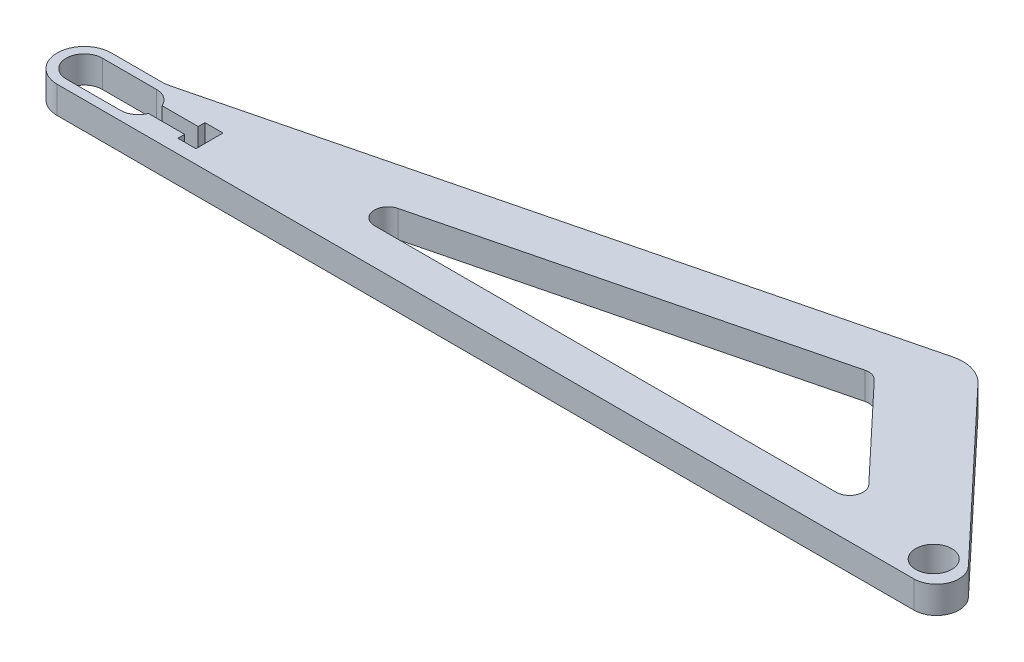
ISO-10303-21;
HEADER;
FILE_DESCRIPTION(('STEP AP214'),'2;1');
FILE_NAME('part.step','',(''),(''),'','','');
FILE_SCHEMA(('AUTOMOTIVE_DESIGN { 1 0 10303 214 1 1 1 1 }'));
ENDSEC;
DATA;
#1=APPLICATION_CONTEXT('core data for automotive mechanical design processes');
#2=APPLICATION_PROTOCOL_DEFINITION('international standard','automotive_design',2000,#1);
#3=PRODUCT_CONTEXT('',#1,'mechanical');
#4=PRODUCT('Part','Part','',(#3));
#5=PRODUCT_RELATED_PRODUCT_CATEGORY('part','',(#4));
#6=PRODUCT_DEFINITION_FORMATION('','',#4);
#7=PRODUCT_DEFINITION_CONTEXT('part definition',#1,'design');
#8=PRODUCT_DEFINITION('design','',#6,#7);
#9=PRODUCT_DEFINITION_SHAPE('','',#8);
#10=(LENGTH_UNIT() NAMED_UNIT(*) SI_UNIT(.MILLI.,.METRE.));
#11=(NAMED_UNIT(*) PLANE_ANGLE_UNIT() SI_UNIT($,.RADIAN.));
#12=(NAMED_UNIT(*) SI_UNIT($,.STERADIAN.) SOLID_ANGLE_UNIT());
#13=UNCERTAINTY_MEASURE_WITH_UNIT(LENGTH_MEASURE(1.E-05),#10,'distance_accuracy_value','');
#14=(GEOMETRIC_REPRESENTATION_CONTEXT(3) GLOBAL_UNCERTAINTY_ASSIGNED_CONTEXT((#13)) GLOBAL_UNIT_ASSIGNED_CONTEXT((#10,
#11,#12)) REPRESENTATION_CONTEXT('',''));
#15=CARTESIAN_POINT('',(0.,0.,0.));
#16=DIRECTION('',(0.,0.,1.));
#17=DIRECTION('',(1.,0.,0.));
#18=AXIS2_PLACEMENT_3D('',#15,#16,#17);
#19=CARTESIAN_POINT('',(5.09378784851541,19.05,3.175));
#20=DIRECTION('',(0.,-1.,0.));
#21=DIRECTION('',(0.,0.,-1.));
#22=AXIS2_PLACEMENT_3D('',#19,#20,#21);
#23=PLANE('',#22);
#24=CARTESIAN_POINT('',(-596.9,19.05,0.));
#25=DIRECTION('',(0.,1.,0.));
#26=DIRECTION('',(0.,0.,1.));
#27=AXIS2_PLACEMENT_3D('',#24,#25,#26);
#28=CIRCLE('',#27,12.7);
#29=CARTESIAN_POINT('',(-596.9,19.05,-12.6999999999999));
#30=VERTEX_POINT('',#29);
#31=CARTESIAN_POINT('',(-596.9,19.05,12.7000000000001));
#32=VERTEX_POINT('',#31);
#33=EDGE_CURVE('E260',#30,#32,#28,.T.);
#34=ORIENTED_EDGE('',*,*,#33,.F.);
#35=DIRECTION('',(-1.,0.,0.));
#36=VECTOR('',#35,1.);
#37=CARTESIAN_POINT('',(-596.9,19.05,-12.6999999999999));
#38=LINE('',#37,#36);
#39=CARTESIAN_POINT('',(-558.8,19.05,-12.6999999999999));
#40=VERTEX_POINT('',#39);
#41=EDGE_CURVE('E284',#40,#30,#38,.T.);
#42=ORIENTED_EDGE('',*,*,#41,.F.);
#43=CARTESIAN_POINT('',(-558.8,19.05,0.));
#44=DIRECTION('',(0.,1.,0.));
#45=DIRECTION('',(0.,0.,1.));
#46=AXIS2_PLACEMENT_3D('',#43,#44,#45);
#47=CIRCLE('',#46,12.7);
#48=CARTESIAN_POINT('',(-547.026784901736,19.05,-4.76249999999993));
#49=VERTEX_POINT('',#48);
#50=EDGE_CURVE('E281',#49,#40,#47,.T.);
#51=ORIENTED_EDGE('',*,*,#50,.F.);
#52=DIRECTION('',(-1.,0.,0.));
#53=VECTOR('',#52,1.);
#54=CARTESIAN_POINT('',(-547.026784901736,19.05,-4.76249999999993));
#55=LINE('',#54,#53);
#56=CARTESIAN_POINT('',(-521.626784901736,19.05,-4.76249999999993));
#57=VERTEX_POINT('',#56);
#58=EDGE_CURVE('E279',#57,#49,#55,.T.);
#59=ORIENTED_EDGE('',*,*,#58,.F.);
#60=DIRECTION('',(0.,0.,1.));
#61=VECTOR('',#60,1.);
#62=CARTESIAN_POINT('',(-521.626784901736,19.05,-4.76249999999993));
#63=LINE('',#62,#61);
#64=CARTESIAN_POINT('',(-521.626784901736,19.05,-9.52499999999993));
#65=VERTEX_POINT('',#64);
#66=EDGE_CURVE('E277',#65,#57,#63,.T.);
#67=ORIENTED_EDGE('',*,*,#66,.F.);
#68=DIRECTION('',(-1.,0.,0.));
#69=VECTOR('',#68,1.);
#70=CARTESIAN_POINT('',(-521.626784901736,19.05,-9.52499999999993));
#71=LINE('',#70,#69);
#72=CARTESIAN_POINT('',(-508.926784901736,19.05,-9.52499999999993));
#73=VERTEX_POINT('',#72);
#74=EDGE_CURVE('E275',#73,#65,#71,.T.);
#75=ORIENTED_EDGE('',*,*,#74,.F.);
#76=DIRECTION('',(0.,0.,-1.));
#77=VECTOR('',#76,1.);
#78=CARTESIAN_POINT('',(-508.926784901736,19.05,9.52500000000006));
#79=LINE('',#78,#77);
#80=CARTESIAN_POINT('',(-508.926784901736,19.05,9.52500000000006));
#81=VERTEX_POINT('',#80);
#82=EDGE_CURVE('E273',#81,#73,#79,.T.);
#83=ORIENTED_EDGE('',*,*,#82,.F.);
#84=DIRECTION('',(1.,0.,0.));
#85=VECTOR('',#84,1.);
#86=CARTESIAN_POINT('',(-521.626784901736,19.05,9.52500000000006));
#87=LINE('',#86,#85);
#88=CARTESIAN_POINT('',(-521.626784901736,19.05,9.52500000000006));
#89=VERTEX_POINT('',#88);
#90=EDGE_CURVE('E271',#89,#81,#87,.T.);
#91=ORIENTED_EDGE('',*,*,#90,.F.);
#92=DIRECTION('',(0.,0.,1.));
#93=VECTOR('',#92,1.);
#94=CARTESIAN_POINT('',(-521.626784901736,19.05,4.76250000000007));
#95=LINE('',#94,#93);
#96=CARTESIAN_POINT('',(-521.626784901736,19.05,4.76250000000007));
#97=VERTEX_POINT('',#96);
#98=EDGE_CURVE('E269',#97,#89,#95,.T.);
#99=ORIENTED_EDGE('',*,*,#98,.F.);
#100=DIRECTION('',(1.,0.,0.));
#101=VECTOR('',#100,1.);
#102=CARTESIAN_POINT('',(-547.026784901736,19.05,4.76250000000007));
#103=LINE('',#102,#101);
#104=CARTESIAN_POINT('',(-547.026784901736,19.05,4.76250000000007));
#105=VERTEX_POINT('',#104);
#106=EDGE_CURVE('E267',#105,#97,#103,.T.);
#107=ORIENTED_EDGE('',*,*,#106,.F.);
#108=CARTESIAN_POINT('',(-558.8,19.05,0.));
#109=DIRECTION('',(0.,1.,0.));
#110=DIRECTION('',(0.,0.,1.));
#111=AXIS2_PLACEMENT_3D('',#108,#109,#110);
#112=CIRCLE('',#111,12.7);
#113=CARTESIAN_POINT('',(-558.8,19.05,12.7000000000001));
#114=VERTEX_POINT('',#113);
#115=EDGE_CURVE('E265',#114,#105,#112,.T.);
#116=ORIENTED_EDGE('',*,*,#115,.F.);
#117=DIRECTION('',(1.,0.,0.));
#118=VECTOR('',#117,1.);
#119=CARTESIAN_POINT('',(-596.9,19.05,12.7000000000001));
#120=LINE('',#119,#118);
#121=EDGE_CURVE('E262',#32,#114,#120,.T.);
#122=ORIENTED_EDGE('',*,*,#121,.F.);
#123=EDGE_LOOP('',(#34,#42,#51,#59,#67,#75,#83,#91,#99,#107,#116,#122));
#124=FACE_BOUND('',#123,.T.);
#125=DIRECTION('',(1.,0.,0.));
#126=VECTOR('',#125,1.);
#127=CARTESIAN_POINT('',(0.,19.05,19.05));
#128=LINE('',#127,#126);
#129=CARTESIAN_POINT('',(-596.9,19.05,19.0500000000001));
#130=VERTEX_POINT('',#129);
#131=CARTESIAN_POINT('',(5.09378784851506,19.05,19.05));
#132=VERTEX_POINT('',#131);
#133=EDGE_CURVE('E353',#130,#132,#128,.T.);
#134=ORIENTED_EDGE('',*,*,#133,.T.);
#135=CARTESIAN_POINT('',(5.09378784851541,19.05,3.175));
#136=DIRECTION('',(0.,1.,0.));
#137=DIRECTION('',(0.,0.,-1.));
#138=AXIS2_PLACEMENT_3D('',#135,#136,#137);
#139=CIRCLE('',#138,15.875);
#140=CARTESIAN_POINT('',(16.6539627325134,19.05,-7.70516459670449));
#141=VERTEX_POINT('',#140);
#142=EDGE_CURVE('E356',#132,#141,#139,.T.);
#143=ORIENTED_EDGE('',*,*,#142,.T.);
#144=DIRECTION('',(-0.685364699004991,0.,-0.728199992692803));
#145=VECTOR('',#144,1.);
#146=CARTESIAN_POINT('',(0.,19.05,-25.4));
#147=LINE('',#146,#145);
#148=CARTESIAN_POINT('',(-91.392360135966,19.05,-122.504382644464));
#149=VERTEX_POINT('',#148);
#150=EDGE_CURVE('E359',#141,#149,#147,.T.);
#151=ORIENTED_EDGE('',*,*,#150,.T.);
#152=CARTESIAN_POINT('',(-109.888639950363,19.05,-105.096119289737));
#153=DIRECTION('',(0.,1.,0.));
#154=DIRECTION('',(0.,0.,-1.));
#155=AXIS2_PLACEMENT_3D('',#152,#153,#154);
#156=CIRCLE('',#155,25.4);
#157=CARTESIAN_POINT('',(-116.049044826286,19.05,-129.737738793428));
#158=VERTEX_POINT('',#157);
#159=EDGE_CURVE('E361',#149,#158,#156,.T.);
#160=ORIENTED_EDGE('',*,*,#159,.T.);
#161=DIRECTION('',(-0.970142500145332,0.,0.242535625036333));
#162=VECTOR('',#161,1.);
#163=CARTESIAN_POINT('',(-555.766478014766,19.05,-19.8083804963085));
#164=LINE('',#163,#162);
#165=CARTESIAN_POINT('',(-555.766478014766,19.05,-19.8083804963085));
#166=VERTEX_POINT('',#165);
#167=EDGE_CURVE('E363',#158,#166,#164,.T.);
#168=ORIENTED_EDGE('',*,*,#167,.T.);
#169=CARTESIAN_POINT('',(-561.926882890689,19.05,-44.4499999999999));
#170=DIRECTION('',(0.,-1.,0.));
#171=DIRECTION('',(0.,0.,-1.));
#172=AXIS2_PLACEMENT_3D('',#169,#170,#171);
#173=CIRCLE('',#172,25.4);
#174=CARTESIAN_POINT('',(-561.926882890689,19.05,-19.0499999999999));
#175=VERTEX_POINT('',#174);
#176=EDGE_CURVE('E365',#166,#175,#173,.T.);
#177=ORIENTED_EDGE('',*,*,#176,.T.);
#178=DIRECTION('',(-1.,0.,0.));
#179=VECTOR('',#178,1.);
#180=CARTESIAN_POINT('',(-561.926882890689,19.05,-19.0499999999999));
#181=LINE('',#180,#179);
#182=CARTESIAN_POINT('',(-596.9,19.05,-19.0499999999999));
#183=VERTEX_POINT('',#182);
#184=EDGE_CURVE('E367',#175,#183,#181,.T.);
#185=ORIENTED_EDGE('',*,*,#184,.T.);
#186=CARTESIAN_POINT('',(-596.9,19.05,0.));
#187=DIRECTION('',(0.,1.,0.));
#188=DIRECTION('',(0.,0.,1.));
#189=AXIS2_PLACEMENT_3D('',#186,#187,#188);
#190=CIRCLE('',#189,19.05);
#191=EDGE_CURVE('E369',#183,#130,#190,.T.);
#192=ORIENTED_EDGE('',*,*,#191,.T.);
#193=EDGE_LOOP('',(#134,#143,#151,#160,#168,#177,#185,#192));
#194=FACE_BOUND('',#193,.T.);
#195=CARTESIAN_POINT('',(0.,19.05,0.));
#196=DIRECTION('',(0.,1.,0.));
#197=DIRECTION('',(0.,0.,1.));
#198=AXIS2_PLACEMENT_3D('',#195,#196,#197);
#199=CIRCLE('',#198,12.7);
#200=CARTESIAN_POINT('',(0.,19.05,12.7));
#201=VERTEX_POINT('',#200);
#202=EDGE_CURVE('E347',#201,#201,#199,.T.);
#203=ORIENTED_EDGE('',*,*,#202,.F.);
#204=EDGE_LOOP('',(#203));
#205=FACE_BOUND('',#204,.T.);
#206=CARTESIAN_POINT('',(-399.35637252841,19.05,-15.8749999999999));
#207=DIRECTION('',(0.,1.,0.));
#208=DIRECTION('',(0.,0.,1.));
#209=AXIS2_PLACEMENT_3D('',#206,#207,#208);
#210=CIRCLE('',#209,9.52499999999999);
#211=CARTESIAN_POINT('',(-401.666524356881,19.05,-25.1156073138842));
#212=VERTEX_POINT('',#211);
#213=CARTESIAN_POINT('',(-399.35637252841,19.05,-6.34999999999995));
#214=VERTEX_POINT('',#213);
#215=EDGE_CURVE('E209',#212,#214,#210,.T.);
#216=ORIENTED_EDGE('',*,*,#215,.F.);
#217=DIRECTION('',(-0.970142500145332,0.,0.242535625036333));
#218=VECTOR('',#217,1.);
#219=CARTESIAN_POINT('',(-401.666524356881,19.05,-25.1156073138842));
#220=LINE('',#219,#218);
#221=CARTESIAN_POINT('',(-139.081054890051,19.05,-90.7619746805916));
#222=VERTEX_POINT('',#221);
#223=EDGE_CURVE('E238',#222,#212,#220,.T.);
#224=ORIENTED_EDGE('',*,*,#223,.F.);
#225=CARTESIAN_POINT('',(-136.77090306158,19.05,-81.5213673667074));
#226=DIRECTION('',(0.,1.,0.));
#227=DIRECTION('',(0.,0.,-1.));
#228=AXIS2_PLACEMENT_3D('',#225,#226,#227);
#229=CIRCLE('',#228,9.52499999999998);
#230=CARTESIAN_POINT('',(-129.834798131181,19.05,-88.0494661247299));
#231=VERTEX_POINT('',#230);
#232=EDGE_CURVE('E236',#231,#222,#229,.T.);
#233=ORIENTED_EDGE('',*,*,#232,.F.);
#234=DIRECTION('',(-0.685364699004991,0.,-0.728199992692803));
#235=VECTOR('',#234,1.);
#236=CARTESIAN_POINT('',(-129.834798131181,19.05,-88.0494661247299));
#237=LINE('',#236,#235);
#238=CARTESIAN_POINT('',(-68.0499817860451,19.05,-22.4030987580225));
#239=VERTEX_POINT('',#238);
#240=EDGE_CURVE('E232',#239,#231,#237,.T.);
#241=ORIENTED_EDGE('',*,*,#240,.F.);
#242=CARTESIAN_POINT('',(-74.9860867164441,19.05,-15.875));
#243=DIRECTION('',(0.,1.,0.));
#244=DIRECTION('',(0.,0.,-1.));
#245=AXIS2_PLACEMENT_3D('',#242,#243,#244);
#246=CIRCLE('',#245,9.525);
#247=CARTESIAN_POINT('',(-74.9860867164441,19.05,-6.34999999999999));
#248=VERTEX_POINT('',#247);
#249=EDGE_CURVE('E230',#248,#239,#246,.T.);
#250=ORIENTED_EDGE('',*,*,#249,.F.);
#251=DIRECTION('',(1.,0.,0.));
#252=VECTOR('',#251,1.);
#253=CARTESIAN_POINT('',(-74.9860867164441,19.05,-6.34999999999998));
#254=LINE('',#253,#252);
#255=EDGE_CURVE('E217',#214,#248,#254,.T.);
#256=ORIENTED_EDGE('',*,*,#255,.F.);
#257=EDGE_LOOP('',(#216,#224,#233,#241,#250,#256));
#258=FACE_BOUND('',#257,.T.);
#259=ADVANCED_FACE('F36',(#124,#194,#205,#258),#23,.F.);
#260=CARTESIAN_POINT('',(5.09378784851541,0.,3.175));
#261=DIRECTION('',(0.,-1.,0.));
#262=DIRECTION('',(0.,0.,-1.));
#263=AXIS2_PLACEMENT_3D('',#260,#261,#262);
#264=PLANE('',#263);
#265=DIRECTION('',(-1.,0.,0.));
#266=VECTOR('',#265,1.);
#267=CARTESIAN_POINT('',(-596.9,0.,-12.6999999999999));
#268=LINE('',#267,#266);
#269=CARTESIAN_POINT('',(-558.8,0.,-12.6999999999999));
#270=VERTEX_POINT('',#269);
#271=CARTESIAN_POINT('',(-596.9,0.,-12.6999999999999));
#272=VERTEX_POINT('',#271);
#273=EDGE_CURVE('E263',#270,#272,#268,.T.);
#274=ORIENTED_EDGE('',*,*,#273,.T.);
#275=CARTESIAN_POINT('',(-596.9,0.,0.));
#276=DIRECTION('',(0.,1.,0.));
#277=DIRECTION('',(0.,0.,1.));
#278=AXIS2_PLACEMENT_3D('',#275,#276,#277);
#279=CIRCLE('',#278,12.7);
#280=CARTESIAN_POINT('',(-596.9,0.,12.7000000000001));
#281=VERTEX_POINT('',#280);
#282=EDGE_CURVE('E225',#272,#281,#279,.T.);
#283=ORIENTED_EDGE('',*,*,#282,.T.);
#284=DIRECTION('',(1.,0.,0.));
#285=VECTOR('',#284,1.);
#286=CARTESIAN_POINT('',(-596.9,0.,12.7000000000001));
#287=LINE('',#286,#285);
#288=CARTESIAN_POINT('',(-558.8,0.,12.7000000000001));
#289=VERTEX_POINT('',#288);
#290=EDGE_CURVE('E289',#281,#289,#287,.T.);
#291=ORIENTED_EDGE('',*,*,#290,.T.);
#292=CARTESIAN_POINT('',(-558.8,0.,0.));
#293=DIRECTION('',(0.,1.,0.));
#294=DIRECTION('',(0.,0.,1.));
#295=AXIS2_PLACEMENT_3D('',#292,#293,#294);
#296=CIRCLE('',#295,12.7);
#297=CARTESIAN_POINT('',(-547.026784901736,0.,4.76250000000007));
#298=VERTEX_POINT('',#297);
#299=EDGE_CURVE('E292',#289,#298,#296,.T.);
#300=ORIENTED_EDGE('',*,*,#299,.T.);
#301=DIRECTION('',(1.,0.,0.));
#302=VECTOR('',#301,1.);
#303=CARTESIAN_POINT('',(-547.026784901736,0.,4.76250000000007));
#304=LINE('',#303,#302);
#305=CARTESIAN_POINT('',(-521.626784901736,0.,4.76250000000007));
#306=VERTEX_POINT('',#305);
#307=EDGE_CURVE('E295',#298,#306,#304,.T.);
#308=ORIENTED_EDGE('',*,*,#307,.T.);
#309=DIRECTION('',(0.,0.,1.));
#310=VECTOR('',#309,1.);
#311=CARTESIAN_POINT('',(-521.626784901736,0.,4.76250000000007));
#312=LINE('',#311,#310);
#313=CARTESIAN_POINT('',(-521.626784901736,0.,9.52500000000006));
#314=VERTEX_POINT('',#313);
#315=EDGE_CURVE('E298',#306,#314,#312,.T.);
#316=ORIENTED_EDGE('',*,*,#315,.T.);
#317=DIRECTION('',(1.,0.,0.));
#318=VECTOR('',#317,1.);
#319=CARTESIAN_POINT('',(-521.626784901736,0.,9.52500000000006));
#320=LINE('',#319,#318);
#321=CARTESIAN_POINT('',(-508.926784901736,0.,9.52500000000006));
#322=VERTEX_POINT('',#321);
#323=EDGE_CURVE('E301',#314,#322,#320,.T.);
#324=ORIENTED_EDGE('',*,*,#323,.T.);
#325=DIRECTION('',(0.,0.,-1.));
#326=VECTOR('',#325,1.);
#327=CARTESIAN_POINT('',(-508.926784901736,0.,9.52500000000006));
#328=LINE('',#327,#326);
#329=CARTESIAN_POINT('',(-508.926784901736,0.,-9.52499999999993));
#330=VERTEX_POINT('',#329);
#331=EDGE_CURVE('E304',#322,#330,#328,.T.);
#332=ORIENTED_EDGE('',*,*,#331,.T.);
#333=DIRECTION('',(-1.,0.,0.));
#334=VECTOR('',#333,1.);
#335=CARTESIAN_POINT('',(-521.626784901736,0.,-9.52499999999993));
#336=LINE('',#335,#334);
#337=CARTESIAN_POINT('',(-521.626784901736,0.,-9.52499999999993));
#338=VERTEX_POINT('',#337);
#339=EDGE_CURVE('E307',#330,#338,#336,.T.);
#340=ORIENTED_EDGE('',*,*,#339,.T.);
#341=DIRECTION('',(0.,0.,1.));
#342=VECTOR('',#341,1.);
#343=CARTESIAN_POINT('',(-521.626784901736,0.,-4.76249999999993));
#344=LINE('',#343,#342);
#345=CARTESIAN_POINT('',(-521.626784901736,0.,-4.76249999999993));
#346=VERTEX_POINT('',#345);
#347=EDGE_CURVE('E310',#338,#346,#344,.T.);
#348=ORIENTED_EDGE('',*,*,#347,.T.);
#349=DIRECTION('',(-1.,0.,0.));
#350=VECTOR('',#349,1.);
#351=CARTESIAN_POINT('',(-547.026784901736,0.,-4.76249999999993));
#352=LINE('',#351,#350);
#353=CARTESIAN_POINT('',(-547.026784901736,0.,-4.76249999999993));
#354=VERTEX_POINT('',#353);
#355=EDGE_CURVE('E313',#346,#354,#352,.T.);
#356=ORIENTED_EDGE('',*,*,#355,.T.);
#357=CARTESIAN_POINT('',(-558.8,0.,0.));
#358=DIRECTION('',(0.,1.,0.));
#359=DIRECTION('',(0.,0.,1.));
#360=AXIS2_PLACEMENT_3D('',#357,#358,#359);
#361=CIRCLE('',#360,12.7);
#362=EDGE_CURVE('E316',#354,#270,#361,.T.);
#363=ORIENTED_EDGE('',*,*,#362,.T.);
#364=EDGE_LOOP('',(#274,#283,#291,#300,#308,#316,#324,#332,#340,#348,#356,#363));
#365=FACE_BOUND('',#364,.T.);
#366=CARTESIAN_POINT('',(5.09378784851541,0.,3.175));
#367=DIRECTION('',(0.,1.,0.));
#368=DIRECTION('',(0.,0.,-1.));
#369=AXIS2_PLACEMENT_3D('',#366,#367,#368);
#370=CIRCLE('',#369,15.875);
#371=CARTESIAN_POINT('',(5.09378784851506,0.,19.05));
#372=VERTEX_POINT('',#371);
#373=CARTESIAN_POINT('',(16.6539627325134,0.,-7.70516459670449));
#374=VERTEX_POINT('',#373);
#375=EDGE_CURVE('E350',#372,#374,#370,.T.);
#376=ORIENTED_EDGE('',*,*,#375,.F.);
#377=DIRECTION('',(1.,0.,0.));
#378=VECTOR('',#377,1.);
#379=CARTESIAN_POINT('',(0.,0.,19.05));
#380=LINE('',#379,#378);
#381=CARTESIAN_POINT('',(-596.9,0.,19.0500000000001));
#382=VERTEX_POINT('',#381);
#383=EDGE_CURVE('E357',#382,#372,#380,.T.);
#384=ORIENTED_EDGE('',*,*,#383,.F.);
#385=CARTESIAN_POINT('',(-596.9,0.,0.));
#386=DIRECTION('',(0.,1.,0.));
#387=DIRECTION('',(0.,0.,1.));
#388=AXIS2_PLACEMENT_3D('',#385,#386,#387);
#389=CIRCLE('',#388,19.05);
#390=CARTESIAN_POINT('',(-596.9,0.,-19.0499999999999));
#391=VERTEX_POINT('',#390);
#392=EDGE_CURVE('E385',#391,#382,#389,.T.);
#393=ORIENTED_EDGE('',*,*,#392,.F.);
#394=DIRECTION('',(-1.,0.,0.));
#395=VECTOR('',#394,1.);
#396=CARTESIAN_POINT('',(-561.926882890689,0.,-19.0499999999999));
#397=LINE('',#396,#395);
#398=CARTESIAN_POINT('',(-561.926882890689,0.,-19.0499999999999));
#399=VERTEX_POINT('',#398);
#400=EDGE_CURVE('E383',#399,#391,#397,.T.);
#401=ORIENTED_EDGE('',*,*,#400,.F.);
#402=CARTESIAN_POINT('',(-561.926882890689,0.,-44.4499999999999));
#403=DIRECTION('',(0.,-1.,0.));
#404=DIRECTION('',(0.,0.,-1.));
#405=AXIS2_PLACEMENT_3D('',#402,#403,#404);
#406=CIRCLE('',#405,25.4);
#407=CARTESIAN_POINT('',(-555.766478014766,0.,-19.8083804963085));
#408=VERTEX_POINT('',#407);
#409=EDGE_CURVE('E381',#408,#399,#406,.T.);
#410=ORIENTED_EDGE('',*,*,#409,.F.);
#411=DIRECTION('',(-0.970142500145332,0.,0.242535625036333));
#412=VECTOR('',#411,1.);
#413=CARTESIAN_POINT('',(-555.766478014766,0.,-19.8083804963085));
#414=LINE('',#413,#412);
#415=CARTESIAN_POINT('',(-116.049044826286,0.,-129.737738793428));
#416=VERTEX_POINT('',#415);
#417=EDGE_CURVE('E379',#416,#408,#414,.T.);
#418=ORIENTED_EDGE('',*,*,#417,.F.);
#419=CARTESIAN_POINT('',(-109.888639950363,0.,-105.096119289737));
#420=DIRECTION('',(0.,1.,0.));
#421=DIRECTION('',(0.,0.,-1.));
#422=AXIS2_PLACEMENT_3D('',#419,#420,#421);
#423=CIRCLE('',#422,25.4);
#424=CARTESIAN_POINT('',(-91.392360135966,0.,-122.504382644464));
#425=VERTEX_POINT('',#424);
#426=EDGE_CURVE('E377',#425,#416,#423,.T.);
#427=ORIENTED_EDGE('',*,*,#426,.F.);
#428=DIRECTION('',(-0.685364699004991,0.,-0.728199992692803));
#429=VECTOR('',#428,1.);
#430=CARTESIAN_POINT('',(-91.392360135966,0.,-122.504382644464));
#431=LINE('',#430,#429);
#432=EDGE_CURVE('E375',#374,#425,#431,.T.);
#433=ORIENTED_EDGE('',*,*,#432,.F.);
#434=EDGE_LOOP('',(#376,#384,#393,#401,#410,#418,#427,#433));
#435=FACE_BOUND('',#434,.T.);
#436=CARTESIAN_POINT('',(0.,0.,0.));
#437=DIRECTION('',(0.,1.,0.));
#438=DIRECTION('',(0.,0.,1.));
#439=AXIS2_PLACEMENT_3D('',#436,#437,#438);
#440=CIRCLE('',#439,12.7);
#441=CARTESIAN_POINT('',(0.,0.,12.7));
#442=VERTEX_POINT('',#441);
#443=EDGE_CURVE('E346',#442,#442,#440,.T.);
#444=ORIENTED_EDGE('',*,*,#443,.T.);
#445=EDGE_LOOP('',(#444));
#446=FACE_BOUND('',#445,.T.);
#447=DIRECTION('',(-0.970142500145332,0.,0.242535625036333));
#448=VECTOR('',#447,1.);
#449=CARTESIAN_POINT('',(-401.666524356881,0.,-25.1156073138842));
#450=LINE('',#449,#448);
#451=CARTESIAN_POINT('',(-139.081054890051,0.,-90.7619746805916));
#452=VERTEX_POINT('',#451);
#453=CARTESIAN_POINT('',(-401.666524356881,0.,-25.1156073138842));
#454=VERTEX_POINT('',#453);
#455=EDGE_CURVE('E218',#452,#454,#450,.T.);
#456=ORIENTED_EDGE('',*,*,#455,.T.);
#457=CARTESIAN_POINT('',(-399.35637252841,0.,-15.8749999999999));
#458=DIRECTION('',(0.,1.,0.));
#459=DIRECTION('',(0.,0.,1.));
#460=AXIS2_PLACEMENT_3D('',#457,#458,#459);
#461=CIRCLE('',#460,9.52499999999999);
#462=CARTESIAN_POINT('',(-399.35637252841,0.,-6.34999999999995));
#463=VERTEX_POINT('',#462);
#464=EDGE_CURVE('E59',#454,#463,#461,.T.);
#465=ORIENTED_EDGE('',*,*,#464,.T.);
#466=DIRECTION('',(1.,0.,0.));
#467=VECTOR('',#466,1.);
#468=CARTESIAN_POINT('',(-74.9860867164441,0.,-6.34999999999998));
#469=LINE('',#468,#467);
#470=CARTESIAN_POINT('',(-74.9860867164441,0.,-6.34999999999999));
#471=VERTEX_POINT('',#470);
#472=EDGE_CURVE('E224',#463,#471,#469,.T.);
#473=ORIENTED_EDGE('',*,*,#472,.T.);
#474=CARTESIAN_POINT('',(-74.9860867164441,0.,-15.875));
#475=DIRECTION('',(0.,1.,0.));
#476=DIRECTION('',(0.,0.,-1.));
#477=AXIS2_PLACEMENT_3D('',#474,#475,#476);
#478=CIRCLE('',#477,9.525);
#479=CARTESIAN_POINT('',(-68.0499817860451,0.,-22.4030987580225));
#480=VERTEX_POINT('',#479);
#481=EDGE_CURVE('E242',#471,#480,#478,.T.);
#482=ORIENTED_EDGE('',*,*,#481,.T.);
#483=DIRECTION('',(-0.685364699004991,0.,-0.728199992692803));
#484=VECTOR('',#483,1.);
#485=CARTESIAN_POINT('',(-129.834798131181,0.,-88.0494661247299));
#486=LINE('',#485,#484);
#487=CARTESIAN_POINT('',(-129.834798131181,0.,-88.0494661247299));
#488=VERTEX_POINT('',#487);
#489=EDGE_CURVE('E245',#480,#488,#486,.T.);
#490=ORIENTED_EDGE('',*,*,#489,.T.);
#491=CARTESIAN_POINT('',(-136.77090306158,0.,-81.5213673667074));
#492=DIRECTION('',(0.,1.,0.));
#493=DIRECTION('',(0.,0.,-1.));
#494=AXIS2_PLACEMENT_3D('',#491,#492,#493);
#495=CIRCLE('',#494,9.52499999999998);
#496=EDGE_CURVE('E248',#488,#452,#495,.T.);
#497=ORIENTED_EDGE('',*,*,#496,.T.);
#498=EDGE_LOOP('',(#456,#465,#473,#482,#490,#497));
#499=FACE_BOUND('',#498,.T.);
#500=ADVANCED_FACE('F415',(#365,#435,#446,#499),#264,.T.);
#501=CARTESIAN_POINT('',(5.09378784851541,19.05,3.175));
#502=DIRECTION('',(0.,-1.,0.));
#503=DIRECTION('',(0.,0.,-1.));
#504=AXIS2_PLACEMENT_3D('',#501,#502,#503);
#505=CYLINDRICAL_SURFACE('',#504,15.875);
#506=ORIENTED_EDGE('',*,*,#375,.T.);
#507=DIRECTION('',(0.,-1.,0.));
#508=VECTOR('',#507,1.);
#509=CARTESIAN_POINT('',(16.6539627325134,19.05,-7.70516459670449));
#510=LINE('',#509,#508);
#511=EDGE_CURVE('E44',#141,#374,#510,.T.);
#512=ORIENTED_EDGE('',*,*,#511,.F.);
#513=ORIENTED_EDGE('',*,*,#142,.F.);
#514=DIRECTION('',(0.,-1.,0.));
#515=VECTOR('',#514,1.);
#516=CARTESIAN_POINT('',(5.09378784851506,19.05,19.05));
#517=LINE('',#516,#515);
#518=EDGE_CURVE('E11',#132,#372,#517,.T.);
#519=ORIENTED_EDGE('',*,*,#518,.T.);
#520=EDGE_LOOP('',(#506,#512,#513,#519));
#521=FACE_BOUND('',#520,.T.);
#522=ADVANCED_FACE('F38',(#521),#505,.T.);
#523=CARTESIAN_POINT('',(-91.392360135966,19.05,-122.504382644464));
#524=DIRECTION('',(-0.728199992692803,0.,0.685364699004991));
#525=DIRECTION('',(0.685364699004991,0.,0.728199992692803));
#526=AXIS2_PLACEMENT_3D('',#523,#524,#525);
#527=PLANE('',#526);
#528=ORIENTED_EDGE('',*,*,#432,.T.);
#529=DIRECTION('',(0.,-1.,0.));
#530=VECTOR('',#529,1.);
#531=CARTESIAN_POINT('',(-91.392360135966,19.05,-122.504382644464));
#532=LINE('',#531,#530);
#533=EDGE_CURVE('E403',#149,#425,#532,.T.);
#534=ORIENTED_EDGE('',*,*,#533,.F.);
#535=ORIENTED_EDGE('',*,*,#150,.F.);
#536=ORIENTED_EDGE('',*,*,#511,.T.);
#537=EDGE_LOOP('',(#528,#534,#535,#536));
#538=FACE_BOUND('',#537,.T.);
#539=ADVANCED_FACE('F409',(#538),#527,.F.);
#540=CARTESIAN_POINT('',(-109.888639950363,19.05,-105.096119289737));
#541=DIRECTION('',(0.,-1.,0.));
#542=DIRECTION('',(0.,0.,-1.));
#543=AXIS2_PLACEMENT_3D('',#540,#541,#542);
#544=CYLINDRICAL_SURFACE('',#543,25.4);
#545=ORIENTED_EDGE('',*,*,#426,.T.);
#546=DIRECTION('',(0.,-1.,0.));
#547=VECTOR('',#546,1.);
#548=CARTESIAN_POINT('',(-116.049044826286,19.05,-129.737738793428));
#549=LINE('',#548,#547);
#550=EDGE_CURVE('E400',#158,#416,#549,.T.);
#551=ORIENTED_EDGE('',*,*,#550,.F.);
#552=ORIENTED_EDGE('',*,*,#159,.F.);
#553=ORIENTED_EDGE('',*,*,#533,.T.);
#554=EDGE_LOOP('',(#545,#551,#552,#553));
#555=FACE_BOUND('',#554,.T.);
#556=ADVANCED_FACE('F423',(#555),#544,.T.);
#557=CARTESIAN_POINT('',(-555.766478014766,19.05,-19.8083804963085));
#558=DIRECTION('',(0.242535625036333,0.,0.970142500145332));
#559=DIRECTION('',(0.970142500145332,0.,-0.242535625036333));
#560=AXIS2_PLACEMENT_3D('',#557,#558,#559);
#561=PLANE('',#560);
#562=ORIENTED_EDGE('',*,*,#417,.T.);
#563=DIRECTION('',(0.,-1.,0.));
#564=VECTOR('',#563,1.);
#565=CARTESIAN_POINT('',(-555.766478014766,19.05,-19.8083804963085));
#566=LINE('',#565,#564);
#567=EDGE_CURVE('E397',#166,#408,#566,.T.);
#568=ORIENTED_EDGE('',*,*,#567,.F.);
#569=ORIENTED_EDGE('',*,*,#167,.F.);
#570=ORIENTED_EDGE('',*,*,#550,.T.);
#571=EDGE_LOOP('',(#562,#568,#569,#570));
#572=FACE_BOUND('',#571,.T.);
#573=ADVANCED_FACE('F427',(#572),#561,.F.);
#574=CARTESIAN_POINT('',(-561.926882890689,19.05,-44.4499999999999));
#575=DIRECTION('',(0.,-1.,0.));
#576=DIRECTION('',(0.,0.,-1.));
#577=AXIS2_PLACEMENT_3D('',#574,#575,#576);
#578=CYLINDRICAL_SURFACE('',#577,25.4);
#579=ORIENTED_EDGE('',*,*,#409,.T.);
#580=DIRECTION('',(0.,-1.,0.));
#581=VECTOR('',#580,1.);
#582=CARTESIAN_POINT('',(-561.926882890689,19.05,-19.0499999999999));
#583=LINE('',#582,#581);
#584=EDGE_CURVE('E394',#175,#399,#583,.T.);
#585=ORIENTED_EDGE('',*,*,#584,.F.);
#586=ORIENTED_EDGE('',*,*,#176,.F.);
#587=ORIENTED_EDGE('',*,*,#567,.T.);
#588=EDGE_LOOP('',(#579,#585,#586,#587));
#589=FACE_BOUND('',#588,.T.);
#590=ADVANCED_FACE('F445',(#589),#578,.F.);
#591=CARTESIAN_POINT('',(-561.926882890689,19.05,-19.0499999999999));
#592=DIRECTION('',(0.,0.,1.));
#593=DIRECTION('',(1.,0.,0.));
#594=AXIS2_PLACEMENT_3D('',#591,#592,#593);
#595=PLANE('',#594);
#596=ORIENTED_EDGE('',*,*,#400,.T.);
#597=DIRECTION('',(0.,-1.,0.));
#598=VECTOR('',#597,1.);
#599=CARTESIAN_POINT('',(-596.9,19.05,-19.0499999999999));
#600=LINE('',#599,#598);
#601=EDGE_CURVE('E391',#183,#391,#600,.T.);
#602=ORIENTED_EDGE('',*,*,#601,.F.);
#603=ORIENTED_EDGE('',*,*,#184,.F.);
#604=ORIENTED_EDGE('',*,*,#584,.T.);
#605=EDGE_LOOP('',(#596,#602,#603,#604));
#606=FACE_BOUND('',#605,.T.);
#607=ADVANCED_FACE('F442',(#606),#595,.F.);
#608=CARTESIAN_POINT('',(-596.9,19.05,0.));
#609=DIRECTION('',(0.,-1.,0.));
#610=DIRECTION('',(0.,0.,-1.));
#611=AXIS2_PLACEMENT_3D('',#608,#609,#610);
#612=CYLINDRICAL_SURFACE('',#611,19.05);
#613=ORIENTED_EDGE('',*,*,#392,.T.);
#614=DIRECTION('',(0.,-1.,0.));
#615=VECTOR('',#614,1.);
#616=CARTESIAN_POINT('',(-596.9,19.05,19.0500000000001));
#617=LINE('',#616,#615);
#618=EDGE_CURVE('E372',#130,#382,#617,.T.);
#619=ORIENTED_EDGE('',*,*,#618,.F.);
#620=ORIENTED_EDGE('',*,*,#191,.F.);
#621=ORIENTED_EDGE('',*,*,#601,.T.);
#622=EDGE_LOOP('',(#613,#619,#620,#621));
#623=FACE_BOUND('',#622,.T.);
#624=ADVANCED_FACE('F438',(#623),#612,.T.);
#625=CARTESIAN_POINT('',(0.,19.05,19.05));
#626=DIRECTION('',(0.,0.,-1.));
#627=DIRECTION('',(-1.,0.,0.));
#628=AXIS2_PLACEMENT_3D('',#625,#626,#627);
#629=PLANE('',#628);
#630=ORIENTED_EDGE('',*,*,#383,.T.);
#631=ORIENTED_EDGE('',*,*,#518,.F.);
#632=ORIENTED_EDGE('',*,*,#133,.F.);
#633=ORIENTED_EDGE('',*,*,#618,.T.);
#634=EDGE_LOOP('',(#630,#631,#632,#633));
#635=FACE_BOUND('',#634,.T.);
#636=ADVANCED_FACE('F436',(#635),#629,.F.);
#637=CARTESIAN_POINT('',(0.,19.05,0.));
#638=DIRECTION('',(0.,-1.,0.));
#639=DIRECTION('',(0.,0.,-1.));
#640=AXIS2_PLACEMENT_3D('',#637,#638,#639);
#641=CYLINDRICAL_SURFACE('',#640,12.7);
#642=ORIENTED_EDGE('',*,*,#202,.T.);
#643=EDGE_LOOP('',(#642));
#644=FACE_BOUND('',#643,.T.);
#645=ORIENTED_EDGE('',*,*,#443,.F.);
#646=EDGE_LOOP('',(#645));
#647=FACE_BOUND('',#646,.T.);
#648=ADVANCED_FACE('F464',(#644,#647),#641,.F.);
#649=CARTESIAN_POINT('',(-596.9,19.05,0.));
#650=DIRECTION('',(0.,-1.,0.));
#651=DIRECTION('',(0.,0.,-1.));
#652=AXIS2_PLACEMENT_3D('',#649,#650,#651);
#653=CYLINDRICAL_SURFACE('',#652,12.7);
#654=ORIENTED_EDGE('',*,*,#282,.F.);
#655=DIRECTION('',(0.,-1.,0.));
#656=VECTOR('',#655,1.);
#657=CARTESIAN_POINT('',(-596.9,19.05,-12.6999999999999));
#658=LINE('',#657,#656);
#659=EDGE_CURVE('E286',#30,#272,#658,.T.);
#660=ORIENTED_EDGE('',*,*,#659,.F.);
#661=ORIENTED_EDGE('',*,*,#33,.T.);
#662=DIRECTION('',(0.,-1.,0.));
#663=VECTOR('',#662,1.);
#664=CARTESIAN_POINT('',(-596.9,19.05,12.7000000000001));
#665=LINE('',#664,#663);
#666=EDGE_CURVE('E343',#32,#281,#665,.T.);
#667=ORIENTED_EDGE('',*,*,#666,.T.);
#668=EDGE_LOOP('',(#654,#660,#661,#667));
#669=FACE_BOUND('',#668,.T.);
#670=ADVANCED_FACE('F484',(#669),#653,.F.);
#671=CARTESIAN_POINT('',(-596.9,19.05,12.7000000000001));
#672=DIRECTION('',(0.,0.,-1.));
#673=DIRECTION('',(-1.,0.,0.));
#674=AXIS2_PLACEMENT_3D('',#671,#672,#673);
#675=PLANE('',#674);
#676=ORIENTED_EDGE('',*,*,#290,.F.);
#677=ORIENTED_EDGE('',*,*,#666,.F.);
#678=ORIENTED_EDGE('',*,*,#121,.T.);
#679=DIRECTION('',(0.,-1.,0.));
#680=VECTOR('',#679,1.);
#681=CARTESIAN_POINT('',(-558.8,19.05,12.7000000000001));
#682=LINE('',#681,#680);
#683=EDGE_CURVE('E341',#114,#289,#682,.T.);
#684=ORIENTED_EDGE('',*,*,#683,.T.);
#685=EDGE_LOOP('',(#676,#677,#678,#684));
#686=FACE_BOUND('',#685,.T.);
#687=ADVANCED_FACE('F491',(#686),#675,.T.);
#688=CARTESIAN_POINT('',(-558.8,19.05,0.));
#689=DIRECTION('',(0.,-1.,0.));
#690=DIRECTION('',(0.,0.,-1.));
#691=AXIS2_PLACEMENT_3D('',#688,#689,#690);
#692=CYLINDRICAL_SURFACE('',#691,12.7);
#693=ORIENTED_EDGE('',*,*,#299,.F.);
#694=ORIENTED_EDGE('',*,*,#683,.F.);
#695=ORIENTED_EDGE('',*,*,#115,.T.);
#696=DIRECTION('',(0.,-1.,0.));
#697=VECTOR('',#696,1.);
#698=CARTESIAN_POINT('',(-547.026784901736,19.05,4.76250000000007));
#699=LINE('',#698,#697);
#700=EDGE_CURVE('E339',#105,#298,#699,.T.);
#701=ORIENTED_EDGE('',*,*,#700,.T.);
#702=EDGE_LOOP('',(#693,#694,#695,#701));
#703=FACE_BOUND('',#702,.T.);
#704=ADVANCED_FACE('F498',(#703),#692,.F.);
#705=CARTESIAN_POINT('',(-547.026784901736,19.05,4.76250000000007));
#706=DIRECTION('',(0.,0.,-1.));
#707=DIRECTION('',(-1.,0.,0.));
#708=AXIS2_PLACEMENT_3D('',#705,#706,#707);
#709=PLANE('',#708);
#710=ORIENTED_EDGE('',*,*,#307,.F.);
#711=ORIENTED_EDGE('',*,*,#700,.F.);
#712=ORIENTED_EDGE('',*,*,#106,.T.);
#713=DIRECTION('',(0.,-1.,0.));
#714=VECTOR('',#713,1.);
#715=CARTESIAN_POINT('',(-521.626784901736,19.05,4.76250000000007));
#716=LINE('',#715,#714);
#717=EDGE_CURVE('E337',#97,#306,#716,.T.);
#718=ORIENTED_EDGE('',*,*,#717,.T.);
#719=EDGE_LOOP('',(#710,#711,#712,#718));
#720=FACE_BOUND('',#719,.T.);
#721=ADVANCED_FACE('F506',(#720),#709,.T.);
#722=CARTESIAN_POINT('',(-521.626784901736,19.05,4.76250000000007));
#723=DIRECTION('',(1.,0.,0.));
#724=DIRECTION('',(0.,0.,-1.));
#725=AXIS2_PLACEMENT_3D('',#722,#723,#724);
#726=PLANE('',#725);
#727=ORIENTED_EDGE('',*,*,#315,.F.);
#728=ORIENTED_EDGE('',*,*,#717,.F.);
#729=ORIENTED_EDGE('',*,*,#98,.T.);
#730=DIRECTION('',(0.,-1.,0.));
#731=VECTOR('',#730,1.);
#732=CARTESIAN_POINT('',(-521.626784901736,19.05,9.52500000000006));
#733=LINE('',#732,#731);
#734=EDGE_CURVE('E335',#89,#314,#733,.T.);
#735=ORIENTED_EDGE('',*,*,#734,.T.);
#736=EDGE_LOOP('',(#727,#728,#729,#735));
#737=FACE_BOUND('',#736,.T.);
#738=ADVANCED_FACE('F514',(#737),#726,.T.);
#739=CARTESIAN_POINT('',(-521.626784901736,19.05,9.52500000000006));
#740=DIRECTION('',(0.,0.,-1.));
#741=DIRECTION('',(-1.,0.,0.));
#742=AXIS2_PLACEMENT_3D('',#739,#740,#741);
#743=PLANE('',#742);
#744=ORIENTED_EDGE('',*,*,#323,.F.);
#745=ORIENTED_EDGE('',*,*,#734,.F.);
#746=ORIENTED_EDGE('',*,*,#90,.T.);
#747=DIRECTION('',(0.,-1.,0.));
#748=VECTOR('',#747,1.);
#749=CARTESIAN_POINT('',(-508.926784901736,19.05,9.52500000000006));
#750=LINE('',#749,#748);
#751=EDGE_CURVE('E333',#81,#322,#750,.T.);
#752=ORIENTED_EDGE('',*,*,#751,.T.);
#753=EDGE_LOOP('',(#744,#745,#746,#752));
#754=FACE_BOUND('',#753,.T.);
#755=ADVANCED_FACE('F522',(#754),#743,.T.);
#756=CARTESIAN_POINT('',(-508.926784901736,19.05,9.52500000000006));
#757=DIRECTION('',(-1.,0.,0.));
#758=DIRECTION('',(0.,0.,1.));
#759=AXIS2_PLACEMENT_3D('',#756,#757,#758);
#760=PLANE('',#759);
#761=ORIENTED_EDGE('',*,*,#331,.F.);
#762=ORIENTED_EDGE('',*,*,#751,.F.);
#763=ORIENTED_EDGE('',*,*,#82,.T.);
#764=DIRECTION('',(0.,-1.,0.));
#765=VECTOR('',#764,1.);
#766=CARTESIAN_POINT('',(-508.926784901736,19.05,-9.52499999999993));
#767=LINE('',#766,#765);
#768=EDGE_CURVE('E331',#73,#330,#767,.T.);
#769=ORIENTED_EDGE('',*,*,#768,.T.);
#770=EDGE_LOOP('',(#761,#762,#763,#769));
#771=FACE_BOUND('',#770,.T.);
#772=ADVANCED_FACE('F530',(#771),#760,.T.);
#773=CARTESIAN_POINT('',(-521.626784901736,19.05,-9.52499999999993));
#774=DIRECTION('',(0.,0.,1.));
#775=DIRECTION('',(1.,0.,0.));
#776=AXIS2_PLACEMENT_3D('',#773,#774,#775);
#777=PLANE('',#776);
#778=ORIENTED_EDGE('',*,*,#339,.F.);
#779=ORIENTED_EDGE('',*,*,#768,.F.);
#780=ORIENTED_EDGE('',*,*,#74,.T.);
#781=DIRECTION('',(0.,-1.,0.));
#782=VECTOR('',#781,1.);
#783=CARTESIAN_POINT('',(-521.626784901736,19.05,-9.52499999999993));
#784=LINE('',#783,#782);
#785=EDGE_CURVE('E329',#65,#338,#784,.T.);
#786=ORIENTED_EDGE('',*,*,#785,.T.);
#787=EDGE_LOOP('',(#778,#779,#780,#786));
#788=FACE_BOUND('',#787,.T.);
#789=ADVANCED_FACE('F538',(#788),#777,.T.);
#790=CARTESIAN_POINT('',(-521.626784901736,19.05,-4.76249999999993));
#791=DIRECTION('',(1.,0.,0.));
#792=DIRECTION('',(0.,0.,-1.));
#793=AXIS2_PLACEMENT_3D('',#790,#791,#792);
#794=PLANE('',#793);
#795=ORIENTED_EDGE('',*,*,#347,.F.);
#796=ORIENTED_EDGE('',*,*,#785,.F.);
#797=ORIENTED_EDGE('',*,*,#66,.T.);
#798=DIRECTION('',(0.,-1.,0.));
#799=VECTOR('',#798,1.);
#800=CARTESIAN_POINT('',(-521.626784901736,19.05,-4.76249999999993));
#801=LINE('',#800,#799);
#802=EDGE_CURVE('E327',#57,#346,#801,.T.);
#803=ORIENTED_EDGE('',*,*,#802,.T.);
#804=EDGE_LOOP('',(#795,#796,#797,#803));
#805=FACE_BOUND('',#804,.T.);
#806=ADVANCED_FACE('F546',(#805),#794,.T.);
#807=CARTESIAN_POINT('',(-547.026784901736,19.05,-4.76249999999993));
#808=DIRECTION('',(0.,0.,1.));
#809=DIRECTION('',(1.,0.,0.));
#810=AXIS2_PLACEMENT_3D('',#807,#808,#809);
#811=PLANE('',#810);
#812=ORIENTED_EDGE('',*,*,#355,.F.);
#813=ORIENTED_EDGE('',*,*,#802,.F.);
#814=ORIENTED_EDGE('',*,*,#58,.T.);
#815=DIRECTION('',(0.,-1.,0.));
#816=VECTOR('',#815,1.);
#817=CARTESIAN_POINT('',(-547.026784901736,19.05,-4.76249999999993));
#818=LINE('',#817,#816);
#819=EDGE_CURVE('E325',#49,#354,#818,.T.);
#820=ORIENTED_EDGE('',*,*,#819,.T.);
#821=EDGE_LOOP('',(#812,#813,#814,#820));
#822=FACE_BOUND('',#821,.T.);
#823=ADVANCED_FACE('F554',(#822),#811,.T.);
#824=CARTESIAN_POINT('',(-558.8,19.05,0.));
#825=DIRECTION('',(0.,-1.,0.));
#826=DIRECTION('',(0.,0.,-1.));
#827=AXIS2_PLACEMENT_3D('',#824,#825,#826);
#828=CYLINDRICAL_SURFACE('',#827,12.7);
#829=ORIENTED_EDGE('',*,*,#362,.F.);
#830=ORIENTED_EDGE('',*,*,#819,.F.);
#831=ORIENTED_EDGE('',*,*,#50,.T.);
#832=DIRECTION('',(0.,-1.,0.));
#833=VECTOR('',#832,1.);
#834=CARTESIAN_POINT('',(-558.8,19.05,-12.6999999999999));
#835=LINE('',#834,#833);
#836=EDGE_CURVE('E323',#40,#270,#835,.T.);
#837=ORIENTED_EDGE('',*,*,#836,.T.);
#838=EDGE_LOOP('',(#829,#830,#831,#837));
#839=FACE_BOUND('',#838,.T.);
#840=ADVANCED_FACE('F562',(#839),#828,.F.);
#841=CARTESIAN_POINT('',(-596.9,19.05,-12.6999999999999));
#842=DIRECTION('',(0.,0.,1.));
#843=DIRECTION('',(1.,0.,0.));
#844=AXIS2_PLACEMENT_3D('',#841,#842,#843);
#845=PLANE('',#844);
#846=ORIENTED_EDGE('',*,*,#273,.F.);
#847=ORIENTED_EDGE('',*,*,#836,.F.);
#848=ORIENTED_EDGE('',*,*,#41,.T.);
#849=ORIENTED_EDGE('',*,*,#659,.T.);
#850=EDGE_LOOP('',(#846,#847,#848,#849));
#851=FACE_BOUND('',#850,.T.);
#852=ADVANCED_FACE('F570',(#851),#845,.T.);
#853=CARTESIAN_POINT('',(-399.35637252841,19.05,-15.8749999999999));
#854=DIRECTION('',(0.,-1.,0.));
#855=DIRECTION('',(0.,0.,-1.));
#856=AXIS2_PLACEMENT_3D('',#853,#854,#855);
#857=CYLINDRICAL_SURFACE('',#856,9.52499999999999);
#858=ORIENTED_EDGE('',*,*,#464,.F.);
#859=DIRECTION('',(0.,-1.,0.));
#860=VECTOR('',#859,1.);
#861=CARTESIAN_POINT('',(-401.666524356881,19.05,-25.1156073138842));
#862=LINE('',#861,#860);
#863=EDGE_CURVE('E213',#212,#454,#862,.T.);
#864=ORIENTED_EDGE('',*,*,#863,.F.);
#865=ORIENTED_EDGE('',*,*,#215,.T.);
#866=DIRECTION('',(0.,-1.,0.));
#867=VECTOR('',#866,1.);
#868=CARTESIAN_POINT('',(-399.35637252841,19.05,-6.34999999999995));
#869=LINE('',#868,#867);
#870=EDGE_CURVE('E212',#214,#463,#869,.T.);
#871=ORIENTED_EDGE('',*,*,#870,.T.);
#872=EDGE_LOOP('',(#858,#864,#865,#871));
#873=FACE_BOUND('',#872,.T.);
#874=ADVANCED_FACE('F211',(#873),#857,.F.);
#875=CARTESIAN_POINT('',(-74.9860867164441,19.05,-6.34999999999998));
#876=DIRECTION('',(0.,0.,-1.));
#877=DIRECTION('',(-1.,0.,0.));
#878=AXIS2_PLACEMENT_3D('',#875,#876,#877);
#879=PLANE('',#878);
#880=ORIENTED_EDGE('',*,*,#472,.F.);
#881=ORIENTED_EDGE('',*,*,#870,.F.);
#882=ORIENTED_EDGE('',*,*,#255,.T.);
#883=DIRECTION('',(0.,-1.,0.));
#884=VECTOR('',#883,1.);
#885=CARTESIAN_POINT('',(-74.9860867164441,19.05,-6.34999999999999));
#886=LINE('',#885,#884);
#887=EDGE_CURVE('E226',#248,#471,#886,.T.);
#888=ORIENTED_EDGE('',*,*,#887,.T.);
#889=EDGE_LOOP('',(#880,#881,#882,#888));
#890=FACE_BOUND('',#889,.T.);
#891=ADVANCED_FACE('F221',(#890),#879,.T.);
#892=CARTESIAN_POINT('',(-74.9860867164441,19.05,-15.875));
#893=DIRECTION('',(0.,-1.,0.));
#894=DIRECTION('',(0.,0.,-1.));
#895=AXIS2_PLACEMENT_3D('',#892,#893,#894);
#896=CYLINDRICAL_SURFACE('',#895,9.525);
#897=ORIENTED_EDGE('',*,*,#481,.F.);
#898=ORIENTED_EDGE('',*,*,#887,.F.);
#899=ORIENTED_EDGE('',*,*,#249,.T.);
#900=DIRECTION('',(0.,-1.,0.));
#901=VECTOR('',#900,1.);
#902=CARTESIAN_POINT('',(-68.0499817860451,19.05,-22.4030987580225));
#903=LINE('',#902,#901);
#904=EDGE_CURVE('E257',#239,#480,#903,.T.);
#905=ORIENTED_EDGE('',*,*,#904,.T.);
#906=EDGE_LOOP('',(#897,#898,#899,#905));
#907=FACE_BOUND('',#906,.T.);
#908=ADVANCED_FACE('F591',(#907),#896,.F.);
#909=CARTESIAN_POINT('',(-129.834798131181,19.05,-88.0494661247299));
#910=DIRECTION('',(-0.728199992692803,0.,0.685364699004991));
#911=DIRECTION('',(0.685364699004991,0.,0.728199992692803));
#912=AXIS2_PLACEMENT_3D('',#909,#910,#911);
#913=PLANE('',#912);
#914=ORIENTED_EDGE('',*,*,#489,.F.);
#915=ORIENTED_EDGE('',*,*,#904,.F.);
#916=ORIENTED_EDGE('',*,*,#240,.T.);
#917=DIRECTION('',(0.,-1.,0.));
#918=VECTOR('',#917,1.);
#919=CARTESIAN_POINT('',(-129.834798131181,19.05,-88.0494661247299));
#920=LINE('',#919,#918);
#921=EDGE_CURVE('E255',#231,#488,#920,.T.);
#922=ORIENTED_EDGE('',*,*,#921,.T.);
#923=EDGE_LOOP('',(#914,#915,#916,#922));
#924=FACE_BOUND('',#923,.T.);
#925=ADVANCED_FACE('F598',(#924),#913,.T.);
#926=CARTESIAN_POINT('',(-136.77090306158,19.05,-81.5213673667074));
#927=DIRECTION('',(0.,-1.,0.));
#928=DIRECTION('',(0.,0.,-1.));
#929=AXIS2_PLACEMENT_3D('',#926,#927,#928);
#930=CYLINDRICAL_SURFACE('',#929,9.52499999999998);
#931=ORIENTED_EDGE('',*,*,#496,.F.);
#932=ORIENTED_EDGE('',*,*,#921,.F.);
#933=ORIENTED_EDGE('',*,*,#232,.T.);
#934=DIRECTION('',(0.,-1.,0.));
#935=VECTOR('',#934,1.);
#936=CARTESIAN_POINT('',(-139.081054890051,19.05,-90.7619746805916));
#937=LINE('',#936,#935);
#938=EDGE_CURVE('E51',#222,#452,#937,.T.);
#939=ORIENTED_EDGE('',*,*,#938,.T.);
#940=EDGE_LOOP('',(#931,#932,#933,#939));
#941=FACE_BOUND('',#940,.T.);
#942=ADVANCED_FACE('F606',(#941),#930,.F.);
#943=CARTESIAN_POINT('',(-401.666524356881,19.05,-25.1156073138842));
#944=DIRECTION('',(0.242535625036333,0.,0.970142500145332));
#945=DIRECTION('',(0.970142500145332,0.,-0.242535625036333));
#946=AXIS2_PLACEMENT_3D('',#943,#944,#945);
#947=PLANE('',#946);
#948=ORIENTED_EDGE('',*,*,#455,.F.);
#949=ORIENTED_EDGE('',*,*,#938,.F.);
#950=ORIENTED_EDGE('',*,*,#223,.T.);
#951=ORIENTED_EDGE('',*,*,#863,.T.);
#952=EDGE_LOOP('',(#948,#949,#950,#951));
#953=FACE_BOUND('',#952,.T.);
#954=ADVANCED_FACE('F614',(#953),#947,.T.);
#955=CLOSED_SHELL('',(#259,#500,#522,#539,#556,#573,#590,#607,#624,#636,#648,#670,#687,#704,
#721,#738,#755,#772,#789,#806,#823,#840,#852,#874,#891,#908,#925,#942,#954));
#956=MANIFOLD_SOLID_BREP('B2',#955);
#957=ADVANCED_BREP_SHAPE_REPRESENTATION('',(#18,#956),#14);
#958=SHAPE_DEFINITION_REPRESENTATION(#9,#957);
ENDSEC;
END-ISO-10303-21;
